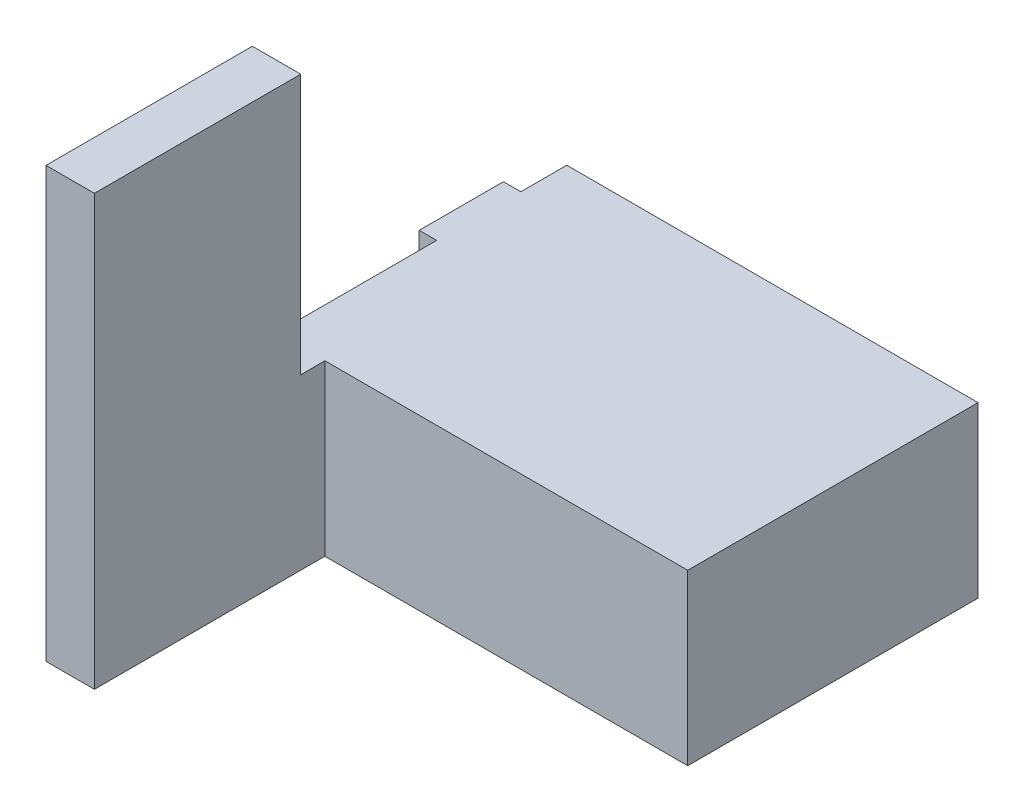
ISO-10303-21;
HEADER;
FILE_DESCRIPTION(('STEP AP214'),'2;1');
FILE_NAME('part.step','',(''),(''),'','','');
FILE_SCHEMA(('AUTOMOTIVE_DESIGN { 1 0 10303 214 1 1 1 1 }'));
ENDSEC;
DATA;
#1=APPLICATION_CONTEXT('core data for automotive mechanical design processes');
#2=APPLICATION_PROTOCOL_DEFINITION('international standard','automotive_design',2000,#1);
#3=PRODUCT_CONTEXT('',#1,'mechanical');
#4=PRODUCT('Part','Part','',(#3));
#5=PRODUCT_RELATED_PRODUCT_CATEGORY('part','',(#4));
#6=PRODUCT_DEFINITION_FORMATION('','',#4);
#7=PRODUCT_DEFINITION_CONTEXT('part definition',#1,'design');
#8=PRODUCT_DEFINITION('design','',#6,#7);
#9=PRODUCT_DEFINITION_SHAPE('','',#8);
#10=(LENGTH_UNIT() NAMED_UNIT(*) SI_UNIT(.MILLI.,.METRE.));
#11=(NAMED_UNIT(*) PLANE_ANGLE_UNIT() SI_UNIT($,.RADIAN.));
#12=(NAMED_UNIT(*) SI_UNIT($,.STERADIAN.) SOLID_ANGLE_UNIT());
#13=UNCERTAINTY_MEASURE_WITH_UNIT(LENGTH_MEASURE(1.E-05),#10,'distance_accuracy_value','');
#14=(GEOMETRIC_REPRESENTATION_CONTEXT(3) GLOBAL_UNCERTAINTY_ASSIGNED_CONTEXT((#13)) GLOBAL_UNIT_ASSIGNED_CONTEXT((#10,
#11,#12)) REPRESENTATION_CONTEXT('',''));
#15=CARTESIAN_POINT('',(0.,0.,0.));
#16=DIRECTION('',(0.,0.,1.));
#17=DIRECTION('',(1.,0.,0.));
#18=AXIS2_PLACEMENT_3D('',#15,#16,#17);
#19=CARTESIAN_POINT('',(-107.95,88.9,-86.0757912621359));
#20=DIRECTION('',(1.,0.,0.));
#21=DIRECTION('',(0.,0.,-1.));
#22=AXIS2_PLACEMENT_3D('',#19,#20,#21);
#23=PLANE('',#22);
#24=DIRECTION('',(0.,-1.,0.));
#25=VECTOR('',#24,1.);
#26=CARTESIAN_POINT('',(-107.95,88.9,-61.9457912621359));
#27=LINE('',#26,#25);
#28=CARTESIAN_POINT('',(-107.95,88.9,-61.9457912621359));
#29=VERTEX_POINT('',#28);
#30=CARTESIAN_POINT('',(-107.95,44.704,-61.9457912621359));
#31=VERTEX_POINT('',#30);
#32=EDGE_CURVE('E163',#29,#31,#27,.T.);
#33=ORIENTED_EDGE('',*,*,#32,.F.);
#34=DIRECTION('',(0.,0.,1.));
#35=VECTOR('',#34,1.);
#36=CARTESIAN_POINT('',(-107.95,88.9,-86.0757912621359));
#37=LINE('',#36,#35);
#38=CARTESIAN_POINT('',(-107.95,88.9,-86.0757912621359));
#39=VERTEX_POINT('',#38);
#40=EDGE_CURVE('E222',#39,#29,#37,.T.);
#41=ORIENTED_EDGE('',*,*,#40,.F.);
#42=DIRECTION('',(0.,-1.,0.));
#43=VECTOR('',#42,1.);
#44=CARTESIAN_POINT('',(-107.95,88.9,-86.0757912621359));
#45=LINE('',#44,#43);
#46=CARTESIAN_POINT('',(-107.95,0.,-86.0757912621359));
#47=VERTEX_POINT('',#46);
#48=EDGE_CURVE('E11',#39,#47,#45,.T.);
#49=ORIENTED_EDGE('',*,*,#48,.T.);
#50=DIRECTION('',(0.,0.,1.));
#51=VECTOR('',#50,1.);
#52=CARTESIAN_POINT('',(-107.95,0.,-86.0757912621359));
#53=LINE('',#52,#51);
#54=CARTESIAN_POINT('',(-107.95,0.,187.355208737864));
#55=VERTEX_POINT('',#54);
#56=EDGE_CURVE('E217',#47,#55,#53,.T.);
#57=ORIENTED_EDGE('',*,*,#56,.T.);
#58=DIRECTION('',(0.,-1.,0.));
#59=VECTOR('',#58,1.);
#60=CARTESIAN_POINT('',(-107.95,88.9,187.355208737864));
#61=LINE('',#60,#59);
#62=CARTESIAN_POINT('',(-107.95,225.552,187.355208737864));
#63=VERTEX_POINT('',#62);
#64=EDGE_CURVE('E46',#63,#55,#61,.T.);
#65=ORIENTED_EDGE('',*,*,#64,.F.);
#66=DIRECTION('',(0.,0.,1.));
#67=VECTOR('',#66,1.);
#68=CARTESIAN_POINT('',(-107.95,225.552,79.0242087378641));
#69=LINE('',#68,#67);
#70=CARTESIAN_POINT('',(-107.95,225.552,79.0242087378641));
#71=VERTEX_POINT('',#70);
#72=EDGE_CURVE('E200',#71,#63,#69,.T.);
#73=ORIENTED_EDGE('',*,*,#72,.F.);
#74=DIRECTION('',(0.,-1.,0.));
#75=VECTOR('',#74,1.);
#76=CARTESIAN_POINT('',(-107.95,225.552,79.0242087378641));
#77=LINE('',#76,#75);
#78=CARTESIAN_POINT('',(-107.95,88.9,79.0242087378641));
#79=VERTEX_POINT('',#78);
#80=EDGE_CURVE('E210',#71,#79,#77,.T.);
#81=ORIENTED_EDGE('',*,*,#80,.T.);
#82=CARTESIAN_POINT('',(-107.95,88.9,-17.7497912621359));
#83=VERTEX_POINT('',#82);
#84=EDGE_CURVE('E59',#83,#79,#37,.T.);
#85=ORIENTED_EDGE('',*,*,#84,.F.);
#86=DIRECTION('',(0.,1.,0.));
#87=VECTOR('',#86,1.);
#88=CARTESIAN_POINT('',(-107.95,88.9,-17.7497912621359));
#89=LINE('',#88,#87);
#90=CARTESIAN_POINT('',(-107.95,44.704,-17.7497912621359));
#91=VERTEX_POINT('',#90);
#92=EDGE_CURVE('E160',#91,#83,#89,.T.);
#93=ORIENTED_EDGE('',*,*,#92,.F.);
#94=DIRECTION('',(0.,0.,1.));
#95=VECTOR('',#94,1.);
#96=CARTESIAN_POINT('',(-107.95,44.704,-61.9457912621359));
#97=LINE('',#96,#95);
#98=EDGE_CURVE('E53',#31,#91,#97,.T.);
#99=ORIENTED_EDGE('',*,*,#98,.F.);
#100=EDGE_LOOP('',(#33,#41,#49,#57,#65,#73,#81,#85,#93,#99));
#101=FACE_BOUND('',#100,.T.);
#102=ADVANCED_FACE('F39',(#101),#23,.F.);
#103=CARTESIAN_POINT('',(-82.55,88.9,187.355208737864));
#104=DIRECTION('',(0.,0.,-1.));
#105=DIRECTION('',(-1.,0.,0.));
#106=AXIS2_PLACEMENT_3D('',#103,#104,#105);
#107=PLANE('',#106);
#108=DIRECTION('',(1.,0.,0.));
#109=VECTOR('',#108,1.);
#110=CARTESIAN_POINT('',(-82.55,0.,187.355208737864));
#111=LINE('',#110,#109);
#112=CARTESIAN_POINT('',(-82.55,0.,187.355208737864));
#113=VERTEX_POINT('',#112);
#114=EDGE_CURVE('E234',#55,#113,#111,.T.);
#115=ORIENTED_EDGE('',*,*,#114,.T.);
#116=DIRECTION('',(0.,-1.,0.));
#117=VECTOR('',#116,1.);
#118=CARTESIAN_POINT('',(-82.55,88.9,187.355208737864));
#119=LINE('',#118,#117);
#120=CARTESIAN_POINT('',(-82.55,225.552,187.355208737864));
#121=VERTEX_POINT('',#120);
#122=EDGE_CURVE('E251',#121,#113,#119,.T.);
#123=ORIENTED_EDGE('',*,*,#122,.F.);
#124=DIRECTION('',(1.,0.,0.));
#125=VECTOR('',#124,1.);
#126=CARTESIAN_POINT('',(-107.95,225.552,187.355208737864));
#127=LINE('',#126,#125);
#128=EDGE_CURVE('E203',#63,#121,#127,.T.);
#129=ORIENTED_EDGE('',*,*,#128,.F.);
#130=ORIENTED_EDGE('',*,*,#64,.T.);
#131=EDGE_LOOP('',(#115,#123,#129,#130));
#132=FACE_BOUND('',#131,.T.);
#133=ADVANCED_FACE('F257',(#132),#107,.F.);
#134=CARTESIAN_POINT('',(-82.55,88.9,66.3242087378641));
#135=DIRECTION('',(-1.,0.,0.));
#136=DIRECTION('',(0.,0.,1.));
#137=AXIS2_PLACEMENT_3D('',#134,#135,#136);
#138=PLANE('',#137);
#139=DIRECTION('',(0.,0.,-1.));
#140=VECTOR('',#139,1.);
#141=CARTESIAN_POINT('',(-82.55,0.,66.3242087378641));
#142=LINE('',#141,#140);
#143=CARTESIAN_POINT('',(-82.55,0.,66.3242087378641));
#144=VERTEX_POINT('',#143);
#145=EDGE_CURVE('E236',#113,#144,#142,.T.);
#146=ORIENTED_EDGE('',*,*,#145,.T.);
#147=DIRECTION('',(0.,-1.,0.));
#148=VECTOR('',#147,1.);
#149=CARTESIAN_POINT('',(-82.55,88.9,66.3242087378641));
#150=LINE('',#149,#148);
#151=CARTESIAN_POINT('',(-82.55,88.9,66.3242087378641));
#152=VERTEX_POINT('',#151);
#153=EDGE_CURVE('E248',#152,#144,#150,.T.);
#154=ORIENTED_EDGE('',*,*,#153,.F.);
#155=DIRECTION('',(0.,0.,-1.));
#156=VECTOR('',#155,1.);
#157=CARTESIAN_POINT('',(-82.55,88.9,66.3242087378641));
#158=LINE('',#157,#156);
#159=CARTESIAN_POINT('',(-82.55,88.9,79.0242087378641));
#160=VERTEX_POINT('',#159);
#161=EDGE_CURVE('E225',#160,#152,#158,.T.);
#162=ORIENTED_EDGE('',*,*,#161,.F.);
#163=DIRECTION('',(0.,-1.,0.));
#164=VECTOR('',#163,1.);
#165=CARTESIAN_POINT('',(-82.55,225.552,79.0242087378641));
#166=LINE('',#165,#164);
#167=CARTESIAN_POINT('',(-82.55,225.552,79.0242087378641));
#168=VERTEX_POINT('',#167);
#169=EDGE_CURVE('E214',#168,#160,#166,.T.);
#170=ORIENTED_EDGE('',*,*,#169,.F.);
#171=DIRECTION('',(0.,0.,-1.));
#172=VECTOR('',#171,1.);
#173=CARTESIAN_POINT('',(-82.55,225.552,79.0242087378641));
#174=LINE('',#173,#172);
#175=EDGE_CURVE('E206',#121,#168,#174,.T.);
#176=ORIENTED_EDGE('',*,*,#175,.F.);
#177=ORIENTED_EDGE('',*,*,#122,.T.);
#178=EDGE_LOOP('',(#146,#154,#162,#170,#176,#177));
#179=FACE_BOUND('',#178,.T.);
#180=ADVANCED_FACE('F268',(#179),#138,.F.);
#181=CARTESIAN_POINT('',(-82.55,88.9,66.3242087378641));
#182=DIRECTION('',(0.,0.,-1.));
#183=DIRECTION('',(-1.,0.,0.));
#184=AXIS2_PLACEMENT_3D('',#181,#182,#183);
#185=PLANE('',#184);
#186=DIRECTION('',(1.,0.,0.));
#187=VECTOR('',#186,1.);
#188=CARTESIAN_POINT('',(-82.55,0.,66.3242087378641));
#189=LINE('',#188,#187);
#190=CARTESIAN_POINT('',(107.95,0.,66.3242087378641));
#191=VERTEX_POINT('',#190);
#192=EDGE_CURVE('E238',#144,#191,#189,.T.);
#193=ORIENTED_EDGE('',*,*,#192,.T.);
#194=DIRECTION('',(0.,-1.,0.));
#195=VECTOR('',#194,1.);
#196=CARTESIAN_POINT('',(107.95,88.9,66.3242087378641));
#197=LINE('',#196,#195);
#198=CARTESIAN_POINT('',(107.95,88.9,66.3242087378641));
#199=VERTEX_POINT('',#198);
#200=EDGE_CURVE('E245',#199,#191,#197,.T.);
#201=ORIENTED_EDGE('',*,*,#200,.F.);
#202=DIRECTION('',(1.,0.,0.));
#203=VECTOR('',#202,1.);
#204=CARTESIAN_POINT('',(-82.55,88.9,66.3242087378641));
#205=LINE('',#204,#203);
#206=EDGE_CURVE('E227',#152,#199,#205,.T.);
#207=ORIENTED_EDGE('',*,*,#206,.F.);
#208=ORIENTED_EDGE('',*,*,#153,.T.);
#209=EDGE_LOOP('',(#193,#201,#207,#208));
#210=FACE_BOUND('',#209,.T.);
#211=ADVANCED_FACE('F273',(#210),#185,.F.);
#212=CARTESIAN_POINT('',(107.95,88.9,-86.0757912621359));
#213=DIRECTION('',(-1.,0.,0.));
#214=DIRECTION('',(0.,0.,1.));
#215=AXIS2_PLACEMENT_3D('',#212,#213,#214);
#216=PLANE('',#215);
#217=DIRECTION('',(0.,0.,-1.));
#218=VECTOR('',#217,1.);
#219=CARTESIAN_POINT('',(107.95,0.,-86.0757912621359));
#220=LINE('',#219,#218);
#221=CARTESIAN_POINT('',(107.95,0.,-86.0757912621359));
#222=VERTEX_POINT('',#221);
#223=EDGE_CURVE('E240',#191,#222,#220,.T.);
#224=ORIENTED_EDGE('',*,*,#223,.T.);
#225=DIRECTION('',(0.,-1.,0.));
#226=VECTOR('',#225,1.);
#227=CARTESIAN_POINT('',(107.95,88.9,-86.0757912621359));
#228=LINE('',#227,#226);
#229=CARTESIAN_POINT('',(107.95,88.9,-86.0757912621359));
#230=VERTEX_POINT('',#229);
#231=EDGE_CURVE('E232',#230,#222,#228,.T.);
#232=ORIENTED_EDGE('',*,*,#231,.F.);
#233=DIRECTION('',(0.,0.,-1.));
#234=VECTOR('',#233,1.);
#235=CARTESIAN_POINT('',(107.95,88.9,-86.0757912621359));
#236=LINE('',#235,#234);
#237=EDGE_CURVE('E229',#199,#230,#236,.T.);
#238=ORIENTED_EDGE('',*,*,#237,.F.);
#239=ORIENTED_EDGE('',*,*,#200,.T.);
#240=EDGE_LOOP('',(#224,#232,#238,#239));
#241=FACE_BOUND('',#240,.T.);
#242=ADVANCED_FACE('F297',(#241),#216,.F.);
#243=CARTESIAN_POINT('',(-82.55,88.9,-86.0757912621359));
#244=DIRECTION('',(0.,0.,1.));
#245=DIRECTION('',(1.,0.,0.));
#246=AXIS2_PLACEMENT_3D('',#243,#244,#245);
#247=PLANE('',#246);
#248=DIRECTION('',(-1.,0.,0.));
#249=VECTOR('',#248,1.);
#250=CARTESIAN_POINT('',(-82.55,0.,-86.0757912621359));
#251=LINE('',#250,#249);
#252=EDGE_CURVE('E221',#222,#47,#251,.T.);
#253=ORIENTED_EDGE('',*,*,#252,.T.);
#254=ORIENTED_EDGE('',*,*,#48,.F.);
#255=DIRECTION('',(-1.,0.,0.));
#256=VECTOR('',#255,1.);
#257=CARTESIAN_POINT('',(-82.55,88.9,-86.0757912621359));
#258=LINE('',#257,#256);
#259=EDGE_CURVE('E218',#230,#39,#258,.T.);
#260=ORIENTED_EDGE('',*,*,#259,.F.);
#261=ORIENTED_EDGE('',*,*,#231,.T.);
#262=EDGE_LOOP('',(#253,#254,#260,#261));
#263=FACE_BOUND('',#262,.T.);
#264=ADVANCED_FACE('F300',(#263),#247,.F.);
#265=CARTESIAN_POINT('',(0.,88.9,0.));
#266=DIRECTION('',(0.,1.,0.));
#267=DIRECTION('',(0.,0.,1.));
#268=AXIS2_PLACEMENT_3D('',#265,#266,#267);
#269=PLANE('',#268);
#270=DIRECTION('',(-1.,0.,0.));
#271=VECTOR('',#270,1.);
#272=CARTESIAN_POINT('',(-107.95,88.9,79.0242087378641));
#273=LINE('',#272,#271);
#274=EDGE_CURVE('E199',#160,#79,#273,.T.);
#275=ORIENTED_EDGE('',*,*,#274,.F.);
#276=ORIENTED_EDGE('',*,*,#161,.T.);
#277=ORIENTED_EDGE('',*,*,#206,.T.);
#278=ORIENTED_EDGE('',*,*,#237,.T.);
#279=ORIENTED_EDGE('',*,*,#259,.T.);
#280=ORIENTED_EDGE('',*,*,#40,.T.);
#281=DIRECTION('',(1.,0.,0.));
#282=VECTOR('',#281,1.);
#283=CARTESIAN_POINT('',(-117.094,88.9,-61.9457912621359));
#284=LINE('',#283,#282);
#285=CARTESIAN_POINT('',(-117.094,88.9,-61.9457912621359));
#286=VERTEX_POINT('',#285);
#287=EDGE_CURVE('E541',#286,#29,#284,.T.);
#288=ORIENTED_EDGE('',*,*,#287,.F.);
#289=DIRECTION('',(0.,0.,-1.));
#290=VECTOR('',#289,1.);
#291=CARTESIAN_POINT('',(-117.094,88.9,-61.9457912621359));
#292=LINE('',#291,#290);
#293=CARTESIAN_POINT('',(-117.094,88.9,-17.7497912621359));
#294=VERTEX_POINT('',#293);
#295=EDGE_CURVE('E156',#294,#286,#292,.T.);
#296=ORIENTED_EDGE('',*,*,#295,.F.);
#297=DIRECTION('',(1.,0.,0.));
#298=VECTOR('',#297,1.);
#299=CARTESIAN_POINT('',(-117.094,88.9,-17.7497912621359));
#300=LINE('',#299,#298);
#301=EDGE_CURVE('E169',#294,#83,#300,.T.);
#302=ORIENTED_EDGE('',*,*,#301,.T.);
#303=ORIENTED_EDGE('',*,*,#84,.T.);
#304=EDGE_LOOP('',(#275,#276,#277,#278,#279,#280,#288,#296,#302,#303));
#305=FACE_BOUND('',#304,.T.);
#306=ADVANCED_FACE('F277',(#305),#269,.T.);
#307=CARTESIAN_POINT('',(0.,0.,0.));
#308=DIRECTION('',(0.,1.,0.));
#309=DIRECTION('',(0.,0.,1.));
#310=AXIS2_PLACEMENT_3D('',#307,#308,#309);
#311=PLANE('',#310);
#312=CARTESIAN_POINT('',(95.25,0.,-73.3757912621359));
#313=DIRECTION('',(0.,-1.,0.));
#314=DIRECTION('',(0.,0.,-1.));
#315=AXIS2_PLACEMENT_3D('',#312,#313,#314);
#316=CIRCLE('',#315,1.64999999999998);
#317=CARTESIAN_POINT('',(95.25,0.,-75.0257912621359));
#318=VERTEX_POINT('',#317);
#319=EDGE_CURVE('E164',#318,#318,#316,.T.);
#320=ORIENTED_EDGE('',*,*,#319,.F.);
#321=EDGE_LOOP('',(#320));
#322=FACE_BOUND('',#321,.T.);
#323=CARTESIAN_POINT('',(-96.774,0.,-73.3757912621359));
#324=DIRECTION('',(0.,-1.,0.));
#325=DIRECTION('',(0.,0.,-1.));
#326=AXIS2_PLACEMENT_3D('',#323,#324,#325);
#327=CIRCLE('',#326,1.64999999999998);
#328=CARTESIAN_POINT('',(-96.774,0.,-75.0257912621359));
#329=VERTEX_POINT('',#328);
#330=EDGE_CURVE('E175',#329,#329,#327,.T.);
#331=ORIENTED_EDGE('',*,*,#330,.F.);
#332=EDGE_LOOP('',(#331));
#333=FACE_BOUND('',#332,.T.);
#334=CARTESIAN_POINT('',(46.99,0.,53.6242087378641));
#335=DIRECTION('',(0.,-1.,0.));
#336=DIRECTION('',(0.,0.,-1.));
#337=AXIS2_PLACEMENT_3D('',#334,#335,#336);
#338=CIRCLE('',#337,1.64999999999999);
#339=CARTESIAN_POINT('',(46.99,0.,51.9742087378641));
#340=VERTEX_POINT('',#339);
#341=EDGE_CURVE('E181',#340,#340,#338,.T.);
#342=ORIENTED_EDGE('',*,*,#341,.F.);
#343=EDGE_LOOP('',(#342));
#344=FACE_BOUND('',#343,.T.);
#345=CARTESIAN_POINT('',(-96.774,0.,174.655208737864));
#346=DIRECTION('',(0.,-1.,0.));
#347=DIRECTION('',(0.,0.,-1.));
#348=AXIS2_PLACEMENT_3D('',#345,#346,#347);
#349=CIRCLE('',#348,1.64999999999998);
#350=CARTESIAN_POINT('',(-96.774,0.,173.005208737864));
#351=VERTEX_POINT('',#350);
#352=EDGE_CURVE('E187',#351,#351,#349,.T.);
#353=ORIENTED_EDGE('',*,*,#352,.F.);
#354=EDGE_LOOP('',(#353));
#355=FACE_BOUND('',#354,.T.);
#356=CARTESIAN_POINT('',(-96.774,0.,91.7242087378641));
#357=DIRECTION('',(0.,-1.,0.));
#358=DIRECTION('',(0.,0.,-1.));
#359=AXIS2_PLACEMENT_3D('',#356,#357,#358);
#360=CIRCLE('',#359,1.64999999999998);
#361=CARTESIAN_POINT('',(-96.774,0.,90.0742087378641));
#362=VERTEX_POINT('',#361);
#363=EDGE_CURVE('E193',#362,#362,#360,.T.);
#364=ORIENTED_EDGE('',*,*,#363,.F.);
#365=EDGE_LOOP('',(#364));
#366=FACE_BOUND('',#365,.T.);
#367=ORIENTED_EDGE('',*,*,#56,.F.);
#368=ORIENTED_EDGE('',*,*,#252,.F.);
#369=ORIENTED_EDGE('',*,*,#223,.F.);
#370=ORIENTED_EDGE('',*,*,#192,.F.);
#371=ORIENTED_EDGE('',*,*,#145,.F.);
#372=ORIENTED_EDGE('',*,*,#114,.F.);
#373=EDGE_LOOP('',(#367,#368,#369,#370,#371,#372));
#374=FACE_BOUND('',#373,.T.);
#375=ADVANCED_FACE('F262',(#322,#333,#344,#355,#366,#374),#311,.F.);
#376=CARTESIAN_POINT('',(-107.95,225.552,79.0242087378641));
#377=DIRECTION('',(0.,0.,1.));
#378=DIRECTION('',(1.,0.,0.));
#379=AXIS2_PLACEMENT_3D('',#376,#377,#378);
#380=PLANE('',#379);
#381=ORIENTED_EDGE('',*,*,#274,.T.);
#382=ORIENTED_EDGE('',*,*,#80,.F.);
#383=DIRECTION('',(-1.,0.,0.));
#384=VECTOR('',#383,1.);
#385=CARTESIAN_POINT('',(-107.95,225.552,79.0242087378641));
#386=LINE('',#385,#384);
#387=EDGE_CURVE('E208',#168,#71,#386,.T.);
#388=ORIENTED_EDGE('',*,*,#387,.F.);
#389=ORIENTED_EDGE('',*,*,#169,.T.);
#390=EDGE_LOOP('',(#381,#382,#388,#389));
#391=FACE_BOUND('',#390,.T.);
#392=ADVANCED_FACE('F282',(#391),#380,.F.);
#393=CARTESIAN_POINT('',(0.,225.552,0.));
#394=DIRECTION('',(0.,1.,0.));
#395=DIRECTION('',(0.,0.,1.));
#396=AXIS2_PLACEMENT_3D('',#393,#394,#395);
#397=PLANE('',#396);
#398=ORIENTED_EDGE('',*,*,#72,.T.);
#399=ORIENTED_EDGE('',*,*,#128,.T.);
#400=ORIENTED_EDGE('',*,*,#175,.T.);
#401=ORIENTED_EDGE('',*,*,#387,.T.);
#402=EDGE_LOOP('',(#398,#399,#400,#401));
#403=FACE_BOUND('',#402,.T.);
#404=ADVANCED_FACE('F285',(#403),#397,.T.);
#405=CARTESIAN_POINT('',(-96.774,9.906,91.7242087378641));
#406=DIRECTION('',(0.,-1.,0.));
#407=DIRECTION('',(0.,0.,-1.));
#408=AXIS2_PLACEMENT_3D('',#405,#406,#407);
#409=CONICAL_SURFACE('',#408,1.64999999999998,1.02974425867665);
#410=CARTESIAN_POINT('',(-96.774,10.8974200213955,91.7242087378641));
#411=VERTEX_POINT('',#410);
#412=VERTEX_LOOP('',#411);
#413=FACE_BOUND('',#412,.T.);
#414=CARTESIAN_POINT('',(-96.774,9.906,91.7242087378641));
#415=DIRECTION('',(0.,-1.,0.));
#416=DIRECTION('',(0.,0.,-1.));
#417=AXIS2_PLACEMENT_3D('',#414,#415,#416);
#418=CIRCLE('',#417,1.64999999999998);
#419=CARTESIAN_POINT('',(-96.774,9.906,90.0742087378641));
#420=VERTEX_POINT('',#419);
#421=EDGE_CURVE('E196',#420,#420,#418,.T.);
#422=ORIENTED_EDGE('',*,*,#421,.T.);
#423=EDGE_LOOP('',(#422));
#424=FACE_BOUND('',#423,.T.);
#425=ADVANCED_FACE('F314',(#413,#424),#409,.F.);
#426=CARTESIAN_POINT('',(-96.774,0.,91.7242087378641));
#427=DIRECTION('',(0.,-1.,0.));
#428=DIRECTION('',(0.,0.,-1.));
#429=AXIS2_PLACEMENT_3D('',#426,#427,#428);
#430=CYLINDRICAL_SURFACE('',#429,1.64999999999998);
#431=ORIENTED_EDGE('',*,*,#421,.F.);
#432=EDGE_LOOP('',(#431));
#433=FACE_BOUND('',#432,.T.);
#434=ORIENTED_EDGE('',*,*,#363,.T.);
#435=EDGE_LOOP('',(#434));
#436=FACE_BOUND('',#435,.T.);
#437=ADVANCED_FACE('F317',(#433,#436),#430,.F.);
#438=CARTESIAN_POINT('',(-96.774,9.906,174.655208737864));
#439=DIRECTION('',(0.,-1.,0.));
#440=DIRECTION('',(0.,0.,-1.));
#441=AXIS2_PLACEMENT_3D('',#438,#439,#440);
#442=CONICAL_SURFACE('',#441,1.64999999999998,1.02974425867665);
#443=CARTESIAN_POINT('',(-96.774,10.8974200213955,174.655208737864));
#444=VERTEX_POINT('',#443);
#445=VERTEX_LOOP('',#444);
#446=FACE_BOUND('',#445,.T.);
#447=CARTESIAN_POINT('',(-96.774,9.906,174.655208737864));
#448=DIRECTION('',(0.,-1.,0.));
#449=DIRECTION('',(0.,0.,-1.));
#450=AXIS2_PLACEMENT_3D('',#447,#448,#449);
#451=CIRCLE('',#450,1.64999999999998);
#452=CARTESIAN_POINT('',(-96.774,9.906,173.005208737864));
#453=VERTEX_POINT('',#452);
#454=EDGE_CURVE('E190',#453,#453,#451,.T.);
#455=ORIENTED_EDGE('',*,*,#454,.T.);
#456=EDGE_LOOP('',(#455));
#457=FACE_BOUND('',#456,.T.);
#458=ADVANCED_FACE('F321',(#446,#457),#442,.F.);
#459=CARTESIAN_POINT('',(-96.774,0.,174.655208737864));
#460=DIRECTION('',(0.,-1.,0.));
#461=DIRECTION('',(0.,0.,-1.));
#462=AXIS2_PLACEMENT_3D('',#459,#460,#461);
#463=CYLINDRICAL_SURFACE('',#462,1.64999999999998);
#464=ORIENTED_EDGE('',*,*,#454,.F.);
#465=EDGE_LOOP('',(#464));
#466=FACE_BOUND('',#465,.T.);
#467=ORIENTED_EDGE('',*,*,#352,.T.);
#468=EDGE_LOOP('',(#467));
#469=FACE_BOUND('',#468,.T.);
#470=ADVANCED_FACE('F325',(#466,#469),#463,.F.);
#471=CARTESIAN_POINT('',(46.99,9.906,53.6242087378641));
#472=DIRECTION('',(0.,-1.,0.));
#473=DIRECTION('',(0.,0.,-1.));
#474=AXIS2_PLACEMENT_3D('',#471,#472,#473);
#475=CONICAL_SURFACE('',#474,1.64999999999998,1.02974425867665);
#476=CARTESIAN_POINT('',(46.99,10.8974200213955,53.6242087378641));
#477=VERTEX_POINT('',#476);
#478=VERTEX_LOOP('',#477);
#479=FACE_BOUND('',#478,.T.);
#480=CARTESIAN_POINT('',(46.99,9.906,53.6242087378641));
#481=DIRECTION('',(0.,-1.,0.));
#482=DIRECTION('',(0.,0.,-1.));
#483=AXIS2_PLACEMENT_3D('',#480,#481,#482);
#484=CIRCLE('',#483,1.64999999999998);
#485=CARTESIAN_POINT('',(46.99,9.906,51.9742087378641));
#486=VERTEX_POINT('',#485);
#487=EDGE_CURVE('E184',#486,#486,#484,.T.);
#488=ORIENTED_EDGE('',*,*,#487,.T.);
#489=EDGE_LOOP('',(#488));
#490=FACE_BOUND('',#489,.T.);
#491=ADVANCED_FACE('F329',(#479,#490),#475,.F.);
#492=CARTESIAN_POINT('',(46.99,0.,53.6242087378641));
#493=DIRECTION('',(0.,-1.,0.));
#494=DIRECTION('',(0.,0.,-1.));
#495=AXIS2_PLACEMENT_3D('',#492,#493,#494);
#496=CYLINDRICAL_SURFACE('',#495,1.64999999999999);
#497=ORIENTED_EDGE('',*,*,#487,.F.);
#498=EDGE_LOOP('',(#497));
#499=FACE_BOUND('',#498,.T.);
#500=ORIENTED_EDGE('',*,*,#341,.T.);
#501=EDGE_LOOP('',(#500));
#502=FACE_BOUND('',#501,.T.);
#503=ADVANCED_FACE('F333',(#499,#502),#496,.F.);
#504=CARTESIAN_POINT('',(-96.774,9.906,-73.3757912621359));
#505=DIRECTION('',(0.,-1.,0.));
#506=DIRECTION('',(0.,0.,-1.));
#507=AXIS2_PLACEMENT_3D('',#504,#505,#506);
#508=CONICAL_SURFACE('',#507,1.64999999999998,1.02974425867665);
#509=CARTESIAN_POINT('',(-96.774,10.8974200213955,-73.3757912621359));
#510=VERTEX_POINT('',#509);
#511=VERTEX_LOOP('',#510);
#512=FACE_BOUND('',#511,.T.);
#513=CARTESIAN_POINT('',(-96.774,9.906,-73.3757912621359));
#514=DIRECTION('',(0.,-1.,0.));
#515=DIRECTION('',(0.,0.,-1.));
#516=AXIS2_PLACEMENT_3D('',#513,#514,#515);
#517=CIRCLE('',#516,1.64999999999998);
#518=CARTESIAN_POINT('',(-96.774,9.906,-75.0257912621359));
#519=VERTEX_POINT('',#518);
#520=EDGE_CURVE('E178',#519,#519,#517,.T.);
#521=ORIENTED_EDGE('',*,*,#520,.T.);
#522=EDGE_LOOP('',(#521));
#523=FACE_BOUND('',#522,.T.);
#524=ADVANCED_FACE('F337',(#512,#523),#508,.F.);
#525=CARTESIAN_POINT('',(-96.774,0.,-73.3757912621359));
#526=DIRECTION('',(0.,-1.,0.));
#527=DIRECTION('',(0.,0.,-1.));
#528=AXIS2_PLACEMENT_3D('',#525,#526,#527);
#529=CYLINDRICAL_SURFACE('',#528,1.64999999999998);
#530=ORIENTED_EDGE('',*,*,#520,.F.);
#531=EDGE_LOOP('',(#530));
#532=FACE_BOUND('',#531,.T.);
#533=ORIENTED_EDGE('',*,*,#330,.T.);
#534=EDGE_LOOP('',(#533));
#535=FACE_BOUND('',#534,.T.);
#536=ADVANCED_FACE('F341',(#532,#535),#529,.F.);
#537=CARTESIAN_POINT('',(95.25,9.906,-73.3757912621359));
#538=DIRECTION('',(0.,-1.,0.));
#539=DIRECTION('',(0.,0.,-1.));
#540=AXIS2_PLACEMENT_3D('',#537,#538,#539);
#541=CONICAL_SURFACE('',#540,1.64999999999998,1.02974425867665);
#542=CARTESIAN_POINT('',(95.25,10.8974200213955,-73.3757912621359));
#543=VERTEX_POINT('',#542);
#544=VERTEX_LOOP('',#543);
#545=FACE_BOUND('',#544,.T.);
#546=CARTESIAN_POINT('',(95.25,9.906,-73.3757912621359));
#547=DIRECTION('',(0.,-1.,0.));
#548=DIRECTION('',(0.,0.,-1.));
#549=AXIS2_PLACEMENT_3D('',#546,#547,#548);
#550=CIRCLE('',#549,1.64999999999998);
#551=CARTESIAN_POINT('',(95.25,9.906,-75.0257912621359));
#552=VERTEX_POINT('',#551);
#553=EDGE_CURVE('E167',#552,#552,#550,.T.);
#554=ORIENTED_EDGE('',*,*,#553,.T.);
#555=EDGE_LOOP('',(#554));
#556=FACE_BOUND('',#555,.T.);
#557=ADVANCED_FACE('F345',(#545,#556),#541,.F.);
#558=CARTESIAN_POINT('',(95.25,0.,-73.3757912621359));
#559=DIRECTION('',(0.,-1.,0.));
#560=DIRECTION('',(0.,0.,-1.));
#561=AXIS2_PLACEMENT_3D('',#558,#559,#560);
#562=CYLINDRICAL_SURFACE('',#561,1.64999999999998);
#563=ORIENTED_EDGE('',*,*,#553,.F.);
#564=EDGE_LOOP('',(#563));
#565=FACE_BOUND('',#564,.T.);
#566=ORIENTED_EDGE('',*,*,#319,.T.);
#567=EDGE_LOOP('',(#566));
#568=FACE_BOUND('',#567,.T.);
#569=ADVANCED_FACE('F349',(#565,#568),#562,.F.);
#570=CARTESIAN_POINT('',(-117.094,88.9,-61.9457912621359));
#571=DIRECTION('',(0.,0.,1.));
#572=DIRECTION('',(0.,-1.,0.));
#573=AXIS2_PLACEMENT_3D('',#570,#571,#572);
#574=PLANE('',#573);
#575=ORIENTED_EDGE('',*,*,#32,.T.);
#576=DIRECTION('',(1.,0.,0.));
#577=VECTOR('',#576,1.);
#578=CARTESIAN_POINT('',(-117.094,44.704,-61.9457912621359));
#579=LINE('',#578,#577);
#580=CARTESIAN_POINT('',(-117.094,44.704,-61.9457912621359));
#581=VERTEX_POINT('',#580);
#582=EDGE_CURVE('E144',#581,#31,#579,.T.);
#583=ORIENTED_EDGE('',*,*,#582,.F.);
#584=DIRECTION('',(0.,-1.,0.));
#585=VECTOR('',#584,1.);
#586=CARTESIAN_POINT('',(-117.094,88.9,-61.9457912621359));
#587=LINE('',#586,#585);
#588=EDGE_CURVE('E151',#286,#581,#587,.T.);
#589=ORIENTED_EDGE('',*,*,#588,.F.);
#590=ORIENTED_EDGE('',*,*,#287,.T.);
#591=EDGE_LOOP('',(#575,#583,#589,#590));
#592=FACE_BOUND('',#591,.T.);
#593=ADVANCED_FACE('F162',(#592),#574,.F.);
#594=CARTESIAN_POINT('',(-117.094,44.704,-61.9457912621359));
#595=DIRECTION('',(0.,1.,0.));
#596=DIRECTION('',(0.,0.,1.));
#597=AXIS2_PLACEMENT_3D('',#594,#595,#596);
#598=PLANE('',#597);
#599=ORIENTED_EDGE('',*,*,#98,.T.);
#600=DIRECTION('',(1.,0.,0.));
#601=VECTOR('',#600,1.);
#602=CARTESIAN_POINT('',(-117.094,44.704,-17.7497912621359));
#603=LINE('',#602,#601);
#604=CARTESIAN_POINT('',(-117.094,44.704,-17.7497912621359));
#605=VERTEX_POINT('',#604);
#606=EDGE_CURVE('E147',#605,#91,#603,.T.);
#607=ORIENTED_EDGE('',*,*,#606,.F.);
#608=DIRECTION('',(0.,0.,1.));
#609=VECTOR('',#608,1.);
#610=CARTESIAN_POINT('',(-117.094,44.704,-61.9457912621359));
#611=LINE('',#610,#609);
#612=EDGE_CURVE('E140',#581,#605,#611,.T.);
#613=ORIENTED_EDGE('',*,*,#612,.F.);
#614=ORIENTED_EDGE('',*,*,#582,.T.);
#615=EDGE_LOOP('',(#599,#607,#613,#614));
#616=FACE_BOUND('',#615,.T.);
#617=ADVANCED_FACE('F142',(#616),#598,.F.);
#618=CARTESIAN_POINT('',(-117.094,88.9,-17.7497912621359));
#619=DIRECTION('',(0.,0.,-1.));
#620=DIRECTION('',(0.,1.,0.));
#621=AXIS2_PLACEMENT_3D('',#618,#619,#620);
#622=PLANE('',#621);
#623=ORIENTED_EDGE('',*,*,#92,.T.);
#624=ORIENTED_EDGE('',*,*,#301,.F.);
#625=DIRECTION('',(0.,1.,0.));
#626=VECTOR('',#625,1.);
#627=CARTESIAN_POINT('',(-117.094,88.9,-17.7497912621359));
#628=LINE('',#627,#626);
#629=EDGE_CURVE('E150',#605,#294,#628,.T.);
#630=ORIENTED_EDGE('',*,*,#629,.F.);
#631=ORIENTED_EDGE('',*,*,#606,.T.);
#632=EDGE_LOOP('',(#623,#624,#630,#631));
#633=FACE_BOUND('',#632,.T.);
#634=ADVANCED_FACE('F358',(#633),#622,.F.);
#635=CARTESIAN_POINT('',(-117.094,0.,0.));
#636=DIRECTION('',(-1.,0.,0.));
#637=DIRECTION('',(0.,0.,1.));
#638=AXIS2_PLACEMENT_3D('',#635,#636,#637);
#639=PLANE('',#638);
#640=ORIENTED_EDGE('',*,*,#588,.T.);
#641=ORIENTED_EDGE('',*,*,#612,.T.);
#642=ORIENTED_EDGE('',*,*,#629,.T.);
#643=ORIENTED_EDGE('',*,*,#295,.T.);
#644=EDGE_LOOP('',(#640,#641,#642,#643));
#645=FACE_BOUND('',#644,.T.);
#646=ADVANCED_FACE('F154',(#645),#639,.T.);
#647=CLOSED_SHELL('',(#102,#133,#180,#211,#242,#264,#306,#375,#392,#404,#425,#437,#458,#470,
#491,#503,#524,#536,#557,#569,#593,#617,#634,#646));
#648=MANIFOLD_SOLID_BREP('B2',#647);
#649=ADVANCED_BREP_SHAPE_REPRESENTATION('',(#18,#648),#14);
#650=SHAPE_DEFINITION_REPRESENTATION(#9,#649);
ENDSEC;
END-ISO-10303-21;
